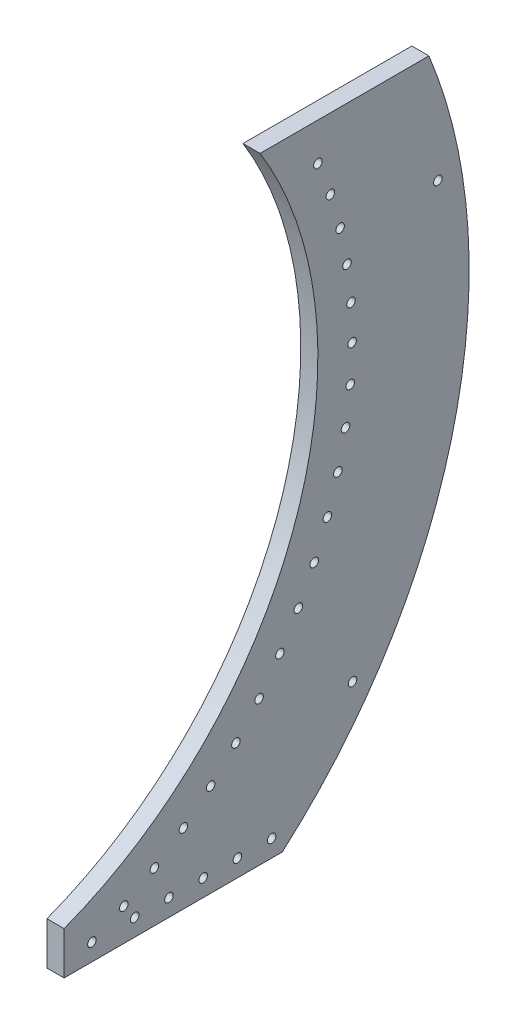
ISO-10303-21;
HEADER;
FILE_DESCRIPTION(('STEP AP214'),'2;1');
FILE_NAME('part.step','',(''),(''),'','','');
FILE_SCHEMA(('AUTOMOTIVE_DESIGN { 1 0 10303 214 1 1 1 1 }'));
ENDSEC;
DATA;
#1=APPLICATION_CONTEXT('core data for automotive mechanical design processes');
#2=APPLICATION_PROTOCOL_DEFINITION('international standard','automotive_design',2000,#1);
#3=PRODUCT_CONTEXT('',#1,'mechanical');
#4=PRODUCT('Part','Part','',(#3));
#5=PRODUCT_RELATED_PRODUCT_CATEGORY('part','',(#4));
#6=PRODUCT_DEFINITION_FORMATION('','',#4);
#7=PRODUCT_DEFINITION_CONTEXT('part definition',#1,'design');
#8=PRODUCT_DEFINITION('design','',#6,#7);
#9=PRODUCT_DEFINITION_SHAPE('','',#8);
#10=(LENGTH_UNIT() NAMED_UNIT(*) SI_UNIT(.MILLI.,.METRE.));
#11=(NAMED_UNIT(*) PLANE_ANGLE_UNIT() SI_UNIT($,.RADIAN.));
#12=(NAMED_UNIT(*) SI_UNIT($,.STERADIAN.) SOLID_ANGLE_UNIT());
#13=UNCERTAINTY_MEASURE_WITH_UNIT(LENGTH_MEASURE(1.E-05),#10,'distance_accuracy_value','');
#14=(GEOMETRIC_REPRESENTATION_CONTEXT(3) GLOBAL_UNCERTAINTY_ASSIGNED_CONTEXT((#13)) GLOBAL_UNIT_ASSIGNED_CONTEXT((#10,
#11,#12)) REPRESENTATION_CONTEXT('',''));
#15=CARTESIAN_POINT('',(0.,0.,0.));
#16=DIRECTION('',(0.,0.,1.));
#17=DIRECTION('',(1.,0.,0.));
#18=AXIS2_PLACEMENT_3D('',#15,#16,#17);
#19=CARTESIAN_POINT('',(12.7,12.7,-52.4380030499122));
#20=DIRECTION('',(-1.,0.,0.));
#21=DIRECTION('',(0.,0.,1.));
#22=AXIS2_PLACEMENT_3D('',#19,#20,#21);
#23=CYLINDRICAL_SURFACE('',#22,3.175);
#24=CARTESIAN_POINT('',(12.7,12.7,-52.4380030499122));
#25=DIRECTION('',(-1.,0.,0.));
#26=DIRECTION('',(0.,0.,1.));
#27=AXIS2_PLACEMENT_3D('',#24,#25,#26);
#28=CIRCLE('',#27,3.175);
#29=CARTESIAN_POINT('',(12.7,12.7,-49.2630030499122));
#30=VERTEX_POINT('',#29);
#31=EDGE_CURVE('E46',#30,#30,#28,.T.);
#32=ORIENTED_EDGE('',*,*,#31,.F.);
#33=EDGE_LOOP('',(#32));
#34=FACE_BOUND('',#33,.T.);
#35=CARTESIAN_POINT('',(0.,12.7,-52.4380030499122));
#36=DIRECTION('',(-1.,0.,0.));
#37=DIRECTION('',(0.,0.,1.));
#38=AXIS2_PLACEMENT_3D('',#35,#36,#37);
#39=CIRCLE('',#38,3.175);
#40=CARTESIAN_POINT('',(0.,12.7,-49.2630030499122));
#41=VERTEX_POINT('',#40);
#42=EDGE_CURVE('E11',#41,#41,#39,.T.);
#43=ORIENTED_EDGE('',*,*,#42,.T.);
#44=EDGE_LOOP('',(#43));
#45=FACE_BOUND('',#44,.T.);
#46=ADVANCED_FACE('F38',(#34,#45),#23,.F.);
#47=CARTESIAN_POINT('',(12.7,12.7,-77.8380030499122));
#48=DIRECTION('',(-1.,0.,0.));
#49=DIRECTION('',(0.,0.,1.));
#50=AXIS2_PLACEMENT_3D('',#47,#48,#49);
#51=CYLINDRICAL_SURFACE('',#50,3.175);
#52=CARTESIAN_POINT('',(12.7,12.7,-77.8380030499122));
#53=DIRECTION('',(-1.,0.,0.));
#54=DIRECTION('',(0.,0.,1.));
#55=AXIS2_PLACEMENT_3D('',#52,#53,#54);
#56=CIRCLE('',#55,3.175);
#57=CARTESIAN_POINT('',(12.7,12.7,-74.6630030499122));
#58=VERTEX_POINT('',#57);
#59=EDGE_CURVE('E121',#58,#58,#56,.T.);
#60=ORIENTED_EDGE('',*,*,#59,.F.);
#61=EDGE_LOOP('',(#60));
#62=FACE_BOUND('',#61,.T.);
#63=CARTESIAN_POINT('',(0.,12.7,-77.8380030499122));
#64=DIRECTION('',(-1.,0.,0.));
#65=DIRECTION('',(0.,0.,1.));
#66=AXIS2_PLACEMENT_3D('',#63,#64,#65);
#67=CIRCLE('',#66,3.175);
#68=CARTESIAN_POINT('',(0.,12.7,-74.6630030499122));
#69=VERTEX_POINT('',#68);
#70=EDGE_CURVE('E125',#69,#69,#67,.T.);
#71=ORIENTED_EDGE('',*,*,#70,.T.);
#72=EDGE_LOOP('',(#71));
#73=FACE_BOUND('',#72,.T.);
#74=ADVANCED_FACE('F136',(#62,#73),#51,.F.);
#75=CARTESIAN_POINT('',(12.7,12.7,-103.238003049912));
#76=DIRECTION('',(-1.,0.,0.));
#77=DIRECTION('',(0.,0.,1.));
#78=AXIS2_PLACEMENT_3D('',#75,#76,#77);
#79=CYLINDRICAL_SURFACE('',#78,3.175);
#80=CARTESIAN_POINT('',(12.7,12.7,-103.238003049912));
#81=DIRECTION('',(-1.,0.,0.));
#82=DIRECTION('',(0.,0.,1.));
#83=AXIS2_PLACEMENT_3D('',#80,#81,#82);
#84=CIRCLE('',#83,3.175);
#85=CARTESIAN_POINT('',(12.7,12.7,-100.063003049912));
#86=VERTEX_POINT('',#85);
#87=EDGE_CURVE('E113',#86,#86,#84,.T.);
#88=ORIENTED_EDGE('',*,*,#87,.F.);
#89=EDGE_LOOP('',(#88));
#90=FACE_BOUND('',#89,.T.);
#91=CARTESIAN_POINT('',(0.,12.7,-103.238003049912));
#92=DIRECTION('',(-1.,0.,0.));
#93=DIRECTION('',(0.,0.,1.));
#94=AXIS2_PLACEMENT_3D('',#91,#92,#93);
#95=CIRCLE('',#94,3.175);
#96=CARTESIAN_POINT('',(0.,12.7,-100.063003049912));
#97=VERTEX_POINT('',#96);
#98=EDGE_CURVE('E117',#97,#97,#95,.T.);
#99=ORIENTED_EDGE('',*,*,#98,.T.);
#100=EDGE_LOOP('',(#99));
#101=FACE_BOUND('',#100,.T.);
#102=ADVANCED_FACE('F163',(#90,#101),#79,.F.);
#103=CARTESIAN_POINT('',(12.7,304.8,103.759854953638));
#104=DIRECTION('',(-1.,0.,0.));
#105=DIRECTION('',(0.,0.,1.));
#106=AXIS2_PLACEMENT_3D('',#103,#104,#105);
#107=CYLINDRICAL_SURFACE('',#106,292.1);
#108=CARTESIAN_POINT('',(12.7,304.8,103.759854953638));
#109=DIRECTION('',(-1.,0.,0.));
#110=DIRECTION('',(0.,0.,1.));
#111=AXIS2_PLACEMENT_3D('',#108,#109,#110);
#112=CIRCLE('',#111,292.1);
#113=CARTESIAN_POINT('',(12.7,457.2,-145.432139299789));
#114=VERTEX_POINT('',#113);
#115=CARTESIAN_POINT('',(12.7,31.75,0.));
#116=VERTEX_POINT('',#115);
#117=EDGE_CURVE('E101',#114,#116,#112,.T.);
#118=ORIENTED_EDGE('',*,*,#117,.F.);
#119=DIRECTION('',(-1.,0.,0.));
#120=VECTOR('',#119,1.);
#121=CARTESIAN_POINT('',(12.7,457.2,-145.432139299789));
#122=LINE('',#121,#120);
#123=CARTESIAN_POINT('',(0.,457.2,-145.432139299789));
#124=VERTEX_POINT('',#123);
#125=EDGE_CURVE('E684',#114,#124,#122,.T.);
#126=ORIENTED_EDGE('',*,*,#125,.T.);
#127=CARTESIAN_POINT('',(0.,304.8,103.759854953638));
#128=DIRECTION('',(-1.,0.,0.));
#129=DIRECTION('',(0.,0.,1.));
#130=AXIS2_PLACEMENT_3D('',#127,#128,#129);
#131=CIRCLE('',#130,292.1);
#132=CARTESIAN_POINT('',(0.,31.75,0.));
#133=VERTEX_POINT('',#132);
#134=EDGE_CURVE('E87',#124,#133,#131,.T.);
#135=ORIENTED_EDGE('',*,*,#134,.T.);
#136=DIRECTION('',(-1.,0.,0.));
#137=VECTOR('',#136,1.);
#138=CARTESIAN_POINT('',(12.7,31.75,0.));
#139=LINE('',#138,#137);
#140=EDGE_CURVE('E81',#116,#133,#139,.T.);
#141=ORIENTED_EDGE('',*,*,#140,.F.);
#142=EDGE_LOOP('',(#118,#126,#135,#141));
#143=FACE_BOUND('',#142,.T.);
#144=ADVANCED_FACE('F160',(#143),#107,.F.);
#145=CARTESIAN_POINT('',(12.7,0.,0.));
#146=DIRECTION('',(0.,0.,-1.));
#147=DIRECTION('',(-1.,0.,0.));
#148=AXIS2_PLACEMENT_3D('',#145,#146,#147);
#149=PLANE('',#148);
#150=DIRECTION('',(0.,-1.,0.));
#151=VECTOR('',#150,1.);
#152=CARTESIAN_POINT('',(0.,0.,0.));
#153=LINE('',#152,#151);
#154=CARTESIAN_POINT('',(0.,0.,0.));
#155=VERTEX_POINT('',#154);
#156=EDGE_CURVE('E75',#133,#155,#153,.T.);
#157=ORIENTED_EDGE('',*,*,#156,.T.);
#158=DIRECTION('',(-1.,0.,0.));
#159=VECTOR('',#158,1.);
#160=CARTESIAN_POINT('',(12.7,0.,0.));
#161=LINE('',#160,#159);
#162=CARTESIAN_POINT('',(12.7,0.,0.));
#163=VERTEX_POINT('',#162);
#164=EDGE_CURVE('E78',#163,#155,#161,.T.);
#165=ORIENTED_EDGE('',*,*,#164,.F.);
#166=DIRECTION('',(0.,-1.,0.));
#167=VECTOR('',#166,1.);
#168=CARTESIAN_POINT('',(12.7,0.,0.));
#169=LINE('',#168,#167);
#170=EDGE_CURVE('E62',#116,#163,#169,.T.);
#171=ORIENTED_EDGE('',*,*,#170,.F.);
#172=ORIENTED_EDGE('',*,*,#140,.T.);
#173=EDGE_LOOP('',(#157,#165,#171,#172));
#174=FACE_BOUND('',#173,.T.);
#175=ADVANCED_FACE('F77',(#174),#149,.F.);
#176=CARTESIAN_POINT('',(12.7,0.,-323.85));
#177=DIRECTION('',(0.,1.,0.));
#178=DIRECTION('',(0.,0.,1.));
#179=AXIS2_PLACEMENT_3D('',#176,#177,#178);
#180=PLANE('',#179);
#181=DIRECTION('',(0.,0.,-1.));
#182=VECTOR('',#181,1.);
#183=CARTESIAN_POINT('',(0.,0.,-323.85));
#184=LINE('',#183,#182);
#185=CARTESIAN_POINT('',(0.,0.,-161.925));
#186=VERTEX_POINT('',#185);
#187=EDGE_CURVE('E86',#155,#186,#184,.T.);
#188=ORIENTED_EDGE('',*,*,#187,.T.);
#189=DIRECTION('',(1.,0.,0.));
#190=VECTOR('',#189,1.);
#191=CARTESIAN_POINT('',(0.,0.,-161.925));
#192=LINE('',#191,#190);
#193=CARTESIAN_POINT('',(12.7,0.,-161.925));
#194=VERTEX_POINT('',#193);
#195=EDGE_CURVE('E511',#186,#194,#192,.T.);
#196=ORIENTED_EDGE('',*,*,#195,.T.);
#197=DIRECTION('',(0.,0.,-1.));
#198=VECTOR('',#197,1.);
#199=CARTESIAN_POINT('',(12.7,0.,-323.85));
#200=LINE('',#199,#198);
#201=EDGE_CURVE('E94',#163,#194,#200,.T.);
#202=ORIENTED_EDGE('',*,*,#201,.F.);
#203=ORIENTED_EDGE('',*,*,#164,.T.);
#204=EDGE_LOOP('',(#188,#196,#202,#203));
#205=FACE_BOUND('',#204,.T.);
#206=ADVANCED_FACE('F91',(#205),#180,.F.);
#207=CARTESIAN_POINT('',(12.7,304.8,103.759854953638));
#208=DIRECTION('',(-1.,0.,0.));
#209=DIRECTION('',(0.,0.,1.));
#210=AXIS2_PLACEMENT_3D('',#207,#208,#209);
#211=PLANE('',#210);
#212=CARTESIAN_POINT('',(12.7,12.7,-128.638003049912));
#213=DIRECTION('',(-1.,0.,0.));
#214=DIRECTION('',(0.,0.,1.));
#215=AXIS2_PLACEMENT_3D('',#212,#213,#214);
#216=CIRCLE('',#215,3.175);
#217=CARTESIAN_POINT('',(12.7,12.7,-125.463003049912));
#218=VERTEX_POINT('',#217);
#219=EDGE_CURVE('E476',#218,#218,#216,.T.);
#220=ORIENTED_EDGE('',*,*,#219,.T.);
#221=EDGE_LOOP('',(#220));
#222=FACE_BOUND('',#221,.T.);
#223=CARTESIAN_POINT('',(12.7,12.7,-154.038003049912));
#224=DIRECTION('',(-1.,0.,0.));
#225=DIRECTION('',(0.,0.,1.));
#226=AXIS2_PLACEMENT_3D('',#223,#224,#225);
#227=CIRCLE('',#226,3.175);
#228=CARTESIAN_POINT('',(12.7,12.7,-150.863003049912));
#229=VERTEX_POINT('',#228);
#230=EDGE_CURVE('E485',#229,#229,#227,.T.);
#231=ORIENTED_EDGE('',*,*,#230,.T.);
#232=EDGE_LOOP('',(#231));
#233=FACE_BOUND('',#232,.T.);
#234=CARTESIAN_POINT('',(12.7,83.3797282703153,-214.065703752946));
#235=DIRECTION('',(1.,0.,0.));
#236=DIRECTION('',(0.,0.,-1.));
#237=AXIS2_PLACEMENT_3D('',#234,#235,#236);
#238=CIRCLE('',#237,3.175);
#239=CARTESIAN_POINT('',(12.7,83.3797282703153,-217.240703752946));
#240=VERTEX_POINT('',#239);
#241=EDGE_CURVE('E498',#240,#240,#238,.T.);
#242=ORIENTED_EDGE('',*,*,#241,.F.);
#243=EDGE_LOOP('',(#242));
#244=FACE_BOUND('',#243,.T.);
#245=CARTESIAN_POINT('',(12.7,373.862081851517,-277.383754923708));
#246=DIRECTION('',(1.,0.,0.));
#247=DIRECTION('',(0.,0.,-1.));
#248=AXIS2_PLACEMENT_3D('',#245,#246,#247);
#249=CIRCLE('',#248,3.17499999999997);
#250=CARTESIAN_POINT('',(12.7,373.862081851517,-280.558754923708));
#251=VERTEX_POINT('',#250);
#252=EDGE_CURVE('E491',#251,#251,#249,.T.);
#253=ORIENTED_EDGE('',*,*,#252,.F.);
#254=EDGE_LOOP('',(#253));
#255=FACE_BOUND('',#254,.T.);
#256=CARTESIAN_POINT('',(12.7,12.7,-20.674223979747));
#257=DIRECTION('',(1.,0.,0.));
#258=DIRECTION('',(0.,0.,-1.));
#259=AXIS2_PLACEMENT_3D('',#256,#257,#258);
#260=CIRCLE('',#259,3.175);
#261=CARTESIAN_POINT('',(12.7,12.7,-23.849223979747));
#262=VERTEX_POINT('',#261);
#263=EDGE_CURVE('E518',#262,#262,#260,.T.);
#264=ORIENTED_EDGE('',*,*,#263,.F.);
#265=EDGE_LOOP('',(#264));
#266=FACE_BOUND('',#265,.T.);
#267=CARTESIAN_POINT('',(12.7,23.9733543855234,-44.37064532541));
#268=DIRECTION('',(1.,0.,0.));
#269=DIRECTION('',(0.,0.,-1.));
#270=AXIS2_PLACEMENT_3D('',#267,#268,#269);
#271=CIRCLE('',#270,3.175);
#272=CARTESIAN_POINT('',(12.7,23.9733543855234,-47.54564532541));
#273=VERTEX_POINT('',#272);
#274=EDGE_CURVE('E528',#273,#273,#271,.T.);
#275=ORIENTED_EDGE('',*,*,#274,.F.);
#276=EDGE_LOOP('',(#275));
#277=FACE_BOUND('',#276,.T.);
#278=CARTESIAN_POINT('',(12.7,37.1650395150662,-67.0551851518159));
#279=DIRECTION('',(1.,0.,0.));
#280=DIRECTION('',(0.,0.,-1.));
#281=AXIS2_PLACEMENT_3D('',#278,#279,#280);
#282=CIRCLE('',#281,3.175);
#283=CARTESIAN_POINT('',(12.7,37.1650395150662,-70.2301851518159));
#284=VERTEX_POINT('',#283);
#285=EDGE_CURVE('E536',#284,#284,#282,.T.);
#286=ORIENTED_EDGE('',*,*,#285,.F.);
#287=EDGE_LOOP('',(#286));
#288=FACE_BOUND('',#287,.T.);
#289=CARTESIAN_POINT('',(12.7,52.184942803001,-88.5728850501294));
#290=DIRECTION('',(1.,0.,0.));
#291=DIRECTION('',(0.,0.,-1.));
#292=AXIS2_PLACEMENT_3D('',#289,#290,#291);
#293=CIRCLE('',#292,3.175);
#294=CARTESIAN_POINT('',(12.7,52.184942803001,-91.7478850501294));
#295=VERTEX_POINT('',#294);
#296=EDGE_CURVE('E544',#295,#295,#293,.T.);
#297=ORIENTED_EDGE('',*,*,#296,.F.);
#298=EDGE_LOOP('',(#297));
#299=FACE_BOUND('',#298,.T.);
#300=CARTESIAN_POINT('',(12.7,68.9304630798894,-108.776757311385));
#301=DIRECTION('',(1.,0.,0.));
#302=DIRECTION('',(0.,0.,-1.));
#303=AXIS2_PLACEMENT_3D('',#300,#301,#302);
#304=CIRCLE('',#303,3.175);
#305=CARTESIAN_POINT('',(12.7,68.9304630798894,-111.951757311385));
#306=VERTEX_POINT('',#305);
#307=EDGE_CURVE('E552',#306,#306,#304,.T.);
#308=ORIENTED_EDGE('',*,*,#307,.F.);
#309=EDGE_LOOP('',(#308));
#310=FACE_BOUND('',#309,.T.);
#311=CARTESIAN_POINT('',(12.7,87.2872114625064,-127.52878900158));
#312=DIRECTION('',(1.,0.,0.));
#313=DIRECTION('',(0.,0.,-1.));
#314=AXIS2_PLACEMENT_3D('',#311,#312,#313);
#315=CIRCLE('',#314,3.175);
#316=CARTESIAN_POINT('',(12.7,87.2872114625064,-130.70378900158));
#317=VERTEX_POINT('',#316);
#318=EDGE_CURVE('E560',#317,#317,#315,.T.);
#319=ORIENTED_EDGE('',*,*,#318,.F.);
#320=EDGE_LOOP('',(#319));
#321=FACE_BOUND('',#320,.T.);
#322=CARTESIAN_POINT('',(12.7,107.1297927459,-144.700884729961));
#323=DIRECTION('',(1.,0.,0.));
#324=DIRECTION('',(0.,0.,-1.));
#325=AXIS2_PLACEMENT_3D('',#322,#323,#324);
#326=CIRCLE('',#325,3.175);
#327=CARTESIAN_POINT('',(12.7,107.1297927459,-147.875884729961));
#328=VERTEX_POINT('',#327);
#329=EDGE_CURVE('E568',#328,#328,#326,.T.);
#330=ORIENTED_EDGE('',*,*,#329,.F.);
#331=EDGE_LOOP('',(#330));
#332=FACE_BOUND('',#331,.T.);
#333=CARTESIAN_POINT('',(12.7,128.322661979793,-160.175741670428));
#334=DIRECTION('',(1.,0.,0.));
#335=DIRECTION('',(0.,0.,-1.));
#336=AXIS2_PLACEMENT_3D('',#333,#334,#335);
#337=CIRCLE('',#336,3.17500000000001);
#338=CARTESIAN_POINT('',(12.7,128.322661979793,-163.350741670428));
#339=VERTEX_POINT('',#338);
#340=EDGE_CURVE('E576',#339,#339,#337,.T.);
#341=ORIENTED_EDGE('',*,*,#340,.F.);
#342=EDGE_LOOP('',(#341));
#343=FACE_BOUND('',#342,.T.);
#344=CARTESIAN_POINT('',(12.7,150.721050378031,-173.847650858778));
#345=DIRECTION('',(1.,0.,0.));
#346=DIRECTION('',(0.,0.,-1.));
#347=AXIS2_PLACEMENT_3D('',#344,#345,#346);
#348=CIRCLE('',#347,3.17500000000001);
#349=CARTESIAN_POINT('',(12.7,150.721050378031,-177.022650858778));
#350=VERTEX_POINT('',#349);
#351=EDGE_CURVE('E584',#350,#350,#348,.T.);
#352=ORIENTED_EDGE('',*,*,#351,.F.);
#353=EDGE_LOOP('',(#352));
#354=FACE_BOUND('',#353,.T.);
#355=CARTESIAN_POINT('',(12.7,174.171954236186,-185.623219292122));
#356=DIRECTION('',(1.,0.,0.));
#357=DIRECTION('',(0.,0.,-1.));
#358=AXIS2_PLACEMENT_3D('',#355,#356,#357);
#359=CIRCLE('',#358,3.17500000000001);
#360=CARTESIAN_POINT('',(12.7,174.171954236186,-188.798219292122));
#361=VERTEX_POINT('',#360);
#362=EDGE_CURVE('E592',#361,#361,#359,.T.);
#363=ORIENTED_EDGE('',*,*,#362,.F.);
#364=EDGE_LOOP('',(#363));
#365=FACE_BOUND('',#364,.T.);
#366=CARTESIAN_POINT('',(12.7,198.515180102004,-195.42200789779));
#367=DIRECTION('',(1.,0.,0.));
#368=DIRECTION('',(0.,0.,-1.));
#369=AXIS2_PLACEMENT_3D('',#366,#367,#368);
#370=CIRCLE('',#369,3.17500000000001);
#371=CARTESIAN_POINT('',(12.7,198.515180102004,-198.59700789779));
#372=VERTEX_POINT('',#371);
#373=EDGE_CURVE('E600',#372,#372,#370,.T.);
#374=ORIENTED_EDGE('',*,*,#373,.F.);
#375=EDGE_LOOP('',(#374));
#376=FACE_BOUND('',#375,.T.);
#377=CARTESIAN_POINT('',(12.7,223.584439059115,-203.177081013765));
#378=DIRECTION('',(1.,0.,0.));
#379=DIRECTION('',(0.,0.,-1.));
#380=AXIS2_PLACEMENT_3D('',#377,#378,#379);
#381=CIRCLE('',#380,3.17500000000001);
#382=CARTESIAN_POINT('',(12.7,223.584439059115,-206.352081013765));
#383=VERTEX_POINT('',#382);
#384=EDGE_CURVE('E608',#383,#383,#381,.T.);
#385=ORIENTED_EDGE('',*,*,#384,.F.);
#386=EDGE_LOOP('',(#385));
#387=FACE_BOUND('',#386,.T.);
#388=CARTESIAN_POINT('',(12.7,249.208482648947,-208.835463627123));
#389=DIRECTION('',(1.,0.,0.));
#390=DIRECTION('',(0.,0.,-1.));
#391=AXIS2_PLACEMENT_3D('',#388,#389,#390);
#392=CIRCLE('',#391,3.17499999999998);
#393=CARTESIAN_POINT('',(12.7,249.208482648947,-212.010463627123));
#394=VERTEX_POINT('',#393);
#395=EDGE_CURVE('E616',#394,#394,#392,.T.);
#396=ORIENTED_EDGE('',*,*,#395,.F.);
#397=EDGE_LOOP('',(#396));
#398=FACE_BOUND('',#397,.T.);
#399=CARTESIAN_POINT('',(12.7,275.212272671344,-212.358503247092));
#400=DIRECTION('',(1.,0.,0.));
#401=DIRECTION('',(0.,0.,-1.));
#402=AXIS2_PLACEMENT_3D('',#399,#400,#401);
#403=CIRCLE('',#402,3.17499999999998);
#404=CARTESIAN_POINT('',(12.7,275.212272671344,-215.533503247092));
#405=VERTEX_POINT('',#404);
#406=EDGE_CURVE('E624',#405,#405,#403,.T.);
#407=ORIENTED_EDGE('',*,*,#406,.F.);
#408=EDGE_LOOP('',(#407));
#409=FACE_BOUND('',#408,.T.);
#410=CARTESIAN_POINT('',(12.7,301.418176872957,-213.722133940752));
#411=DIRECTION('',(1.,0.,0.));
#412=DIRECTION('',(0.,0.,-1.));
#413=AXIS2_PLACEMENT_3D('',#410,#411,#412);
#414=CIRCLE('',#413,3.17499999999998);
#415=CARTESIAN_POINT('',(12.7,301.418176872957,-216.897133940752));
#416=VERTEX_POINT('',#415);
#417=EDGE_CURVE('E632',#416,#416,#414,.T.);
#418=ORIENTED_EDGE('',*,*,#417,.F.);
#419=EDGE_LOOP('',(#418));
#420=FACE_BOUND('',#419,.T.);
#421=CARTESIAN_POINT('',(12.7,327.647182355651,-212.917040727761));
#422=DIRECTION('',(1.,0.,0.));
#423=DIRECTION('',(0.,0.,-1.));
#424=AXIS2_PLACEMENT_3D('',#421,#422,#423);
#425=CIRCLE('',#424,3.17499999999998);
#426=CARTESIAN_POINT('',(12.7,327.647182355651,-216.092040727761));
#427=VERTEX_POINT('',#426);
#428=EDGE_CURVE('E640',#427,#427,#425,.T.);
#429=ORIENTED_EDGE('',*,*,#428,.F.);
#430=EDGE_LOOP('',(#429));
#431=FACE_BOUND('',#430,.T.);
#432=CARTESIAN_POINT('',(12.7,353.720118416118,-209.948723211119));
#433=DIRECTION('',(1.,0.,0.));
#434=DIRECTION('',(0.,0.,-1.));
#435=AXIS2_PLACEMENT_3D('',#432,#433,#434);
#436=CIRCLE('',#435,3.17499999999998);
#437=CARTESIAN_POINT('',(12.7,353.720118416118,-213.123723211119));
#438=VERTEX_POINT('',#437);
#439=EDGE_CURVE('E648',#438,#438,#436,.T.);
#440=ORIENTED_EDGE('',*,*,#439,.F.);
#441=EDGE_LOOP('',(#440));
#442=FACE_BOUND('',#441,.T.);
#443=CARTESIAN_POINT('',(12.7,379.458880463455,-204.837458009297));
#444=DIRECTION('',(1.,0.,0.));
#445=DIRECTION('',(0.,0.,-1.));
#446=AXIS2_PLACEMENT_3D('',#443,#444,#445);
#447=CIRCLE('',#446,3.17499999999998);
#448=CARTESIAN_POINT('',(12.7,379.458880463455,-208.012458009297));
#449=VERTEX_POINT('',#448);
#450=EDGE_CURVE('E656',#449,#449,#447,.T.);
#451=ORIENTED_EDGE('',*,*,#450,.F.);
#452=EDGE_LOOP('',(#451));
#453=FACE_BOUND('',#452,.T.);
#454=CARTESIAN_POINT('',(12.7,404.687646654118,-197.61816024638));
#455=DIRECTION('',(1.,0.,0.));
#456=DIRECTION('',(0.,0.,-1.));
#457=AXIS2_PLACEMENT_3D('',#454,#455,#456);
#458=CIRCLE('',#457,3.17499999999998);
#459=CARTESIAN_POINT('',(12.7,404.687646654118,-200.79316024638));
#460=VERTEX_POINT('',#459);
#461=EDGE_CURVE('E664',#460,#460,#458,.T.);
#462=ORIENTED_EDGE('',*,*,#461,.F.);
#463=EDGE_LOOP('',(#462));
#464=FACE_BOUND('',#463,.T.);
#465=CARTESIAN_POINT('',(12.7,429.234078933392,-188.34014504636));
#466=DIRECTION('',(1.,0.,0.));
#467=DIRECTION('',(0.,0.,-1.));
#468=AXIS2_PLACEMENT_3D('',#465,#466,#467);
#469=CIRCLE('',#468,3.17499999999998);
#470=CARTESIAN_POINT('',(12.7,429.234078933392,-191.51514504636));
#471=VERTEX_POINT('',#470);
#472=EDGE_CURVE('E672',#471,#471,#469,.T.);
#473=ORIENTED_EDGE('',*,*,#472,.F.);
#474=EDGE_LOOP('',(#473));
#475=FACE_BOUND('',#474,.T.);
#476=ORIENTED_EDGE('',*,*,#201,.T.);
#477=CARTESIAN_POINT('',(12.7,304.8,103.759854953638));
#478=DIRECTION('',(-1.,0.,0.));
#479=DIRECTION('',(0.,0.,-1.));
#480=AXIS2_PLACEMENT_3D('',#477,#478,#479);
#481=CIRCLE('',#480,404.340799514142);
#482=CARTESIAN_POINT('',(12.7,457.2,-270.7608015551));
#483=VERTEX_POINT('',#482);
#484=EDGE_CURVE('E497',#483,#194,#481,.T.);
#485=ORIENTED_EDGE('',*,*,#484,.F.);
#486=DIRECTION('',(0.,0.,-1.));
#487=VECTOR('',#486,1.);
#488=CARTESIAN_POINT('',(12.7,457.2,0.));
#489=LINE('',#488,#487);
#490=EDGE_CURVE('E680',#114,#483,#489,.T.);
#491=ORIENTED_EDGE('',*,*,#490,.F.);
#492=ORIENTED_EDGE('',*,*,#117,.T.);
#493=ORIENTED_EDGE('',*,*,#170,.T.);
#494=EDGE_LOOP('',(#476,#485,#491,#492,#493));
#495=FACE_BOUND('',#494,.T.);
#496=ORIENTED_EDGE('',*,*,#87,.T.);
#497=EDGE_LOOP('',(#496));
#498=FACE_BOUND('',#497,.T.);
#499=ORIENTED_EDGE('',*,*,#59,.T.);
#500=EDGE_LOOP('',(#499));
#501=FACE_BOUND('',#500,.T.);
#502=ORIENTED_EDGE('',*,*,#31,.T.);
#503=EDGE_LOOP('',(#502));
#504=FACE_BOUND('',#503,.T.);
#505=ADVANCED_FACE('F132',(#222,#233,#244,#255,#266,#277,#288,#299,#310,#321,#332,#343,#354,
#365,#376,#387,#398,#409,#420,#431,#442,#453,#464,#475,#495,#498,#501,#504),#211,.F.);
#506=CARTESIAN_POINT('',(0.,304.8,103.759854953638));
#507=DIRECTION('',(-1.,0.,0.));
#508=DIRECTION('',(0.,0.,1.));
#509=AXIS2_PLACEMENT_3D('',#506,#507,#508);
#510=PLANE('',#509);
#511=CARTESIAN_POINT('',(0.,12.7,-128.638003049912));
#512=DIRECTION('',(-1.,0.,0.));
#513=DIRECTION('',(0.,0.,1.));
#514=AXIS2_PLACEMENT_3D('',#511,#512,#513);
#515=CIRCLE('',#514,3.175);
#516=CARTESIAN_POINT('',(0.,12.7,-125.463003049912));
#517=VERTEX_POINT('',#516);
#518=EDGE_CURVE('E478',#517,#517,#515,.T.);
#519=ORIENTED_EDGE('',*,*,#518,.F.);
#520=EDGE_LOOP('',(#519));
#521=FACE_BOUND('',#520,.T.);
#522=CARTESIAN_POINT('',(0.,12.7,-154.038003049912));
#523=DIRECTION('',(-1.,0.,0.));
#524=DIRECTION('',(0.,0.,1.));
#525=AXIS2_PLACEMENT_3D('',#522,#523,#524);
#526=CIRCLE('',#525,3.175);
#527=CARTESIAN_POINT('',(0.,12.7,-150.863003049912));
#528=VERTEX_POINT('',#527);
#529=EDGE_CURVE('E480',#528,#528,#526,.T.);
#530=ORIENTED_EDGE('',*,*,#529,.F.);
#531=EDGE_LOOP('',(#530));
#532=FACE_BOUND('',#531,.T.);
#533=CARTESIAN_POINT('',(0.,83.3797282703153,-214.065703752946));
#534=DIRECTION('',(1.,0.,0.));
#535=DIRECTION('',(0.,0.,-1.));
#536=AXIS2_PLACEMENT_3D('',#533,#534,#535);
#537=CIRCLE('',#536,3.175);
#538=CARTESIAN_POINT('',(0.,83.3797282703153,-217.240703752946));
#539=VERTEX_POINT('',#538);
#540=EDGE_CURVE('E493',#539,#539,#537,.T.);
#541=ORIENTED_EDGE('',*,*,#540,.T.);
#542=EDGE_LOOP('',(#541));
#543=FACE_BOUND('',#542,.T.);
#544=CARTESIAN_POINT('',(0.,373.862081851517,-277.383754923708));
#545=DIRECTION('',(1.,0.,0.));
#546=DIRECTION('',(0.,0.,-1.));
#547=AXIS2_PLACEMENT_3D('',#544,#545,#546);
#548=CIRCLE('',#547,3.17499999999997);
#549=CARTESIAN_POINT('',(0.,373.862081851517,-280.558754923708));
#550=VERTEX_POINT('',#549);
#551=EDGE_CURVE('E502',#550,#550,#548,.T.);
#552=ORIENTED_EDGE('',*,*,#551,.T.);
#553=EDGE_LOOP('',(#552));
#554=FACE_BOUND('',#553,.T.);
#555=CARTESIAN_POINT('',(0.,304.8,103.759854953638));
#556=DIRECTION('',(-1.,0.,0.));
#557=DIRECTION('',(0.,0.,-1.));
#558=AXIS2_PLACEMENT_3D('',#555,#556,#557);
#559=CIRCLE('',#558,404.340799514142);
#560=CARTESIAN_POINT('',(0.,457.2,-270.7608015551));
#561=VERTEX_POINT('',#560);
#562=EDGE_CURVE('E53',#561,#186,#559,.T.);
#563=ORIENTED_EDGE('',*,*,#562,.T.);
#564=ORIENTED_EDGE('',*,*,#187,.F.);
#565=ORIENTED_EDGE('',*,*,#156,.F.);
#566=ORIENTED_EDGE('',*,*,#134,.F.);
#567=DIRECTION('',(0.,0.,1.));
#568=VECTOR('',#567,1.);
#569=CARTESIAN_POINT('',(0.,457.2,103.759854953638));
#570=LINE('',#569,#568);
#571=EDGE_CURVE('E109',#561,#124,#570,.T.);
#572=ORIENTED_EDGE('',*,*,#571,.F.);
#573=EDGE_LOOP('',(#563,#564,#565,#566,#572));
#574=FACE_BOUND('',#573,.T.);
#575=CARTESIAN_POINT('',(0.,12.7,-20.674223979747));
#576=DIRECTION('',(1.,0.,0.));
#577=DIRECTION('',(0.,0.,-1.));
#578=AXIS2_PLACEMENT_3D('',#575,#576,#577);
#579=CIRCLE('',#578,3.175);
#580=CARTESIAN_POINT('',(0.,12.7,-23.849223979747));
#581=VERTEX_POINT('',#580);
#582=EDGE_CURVE('E524',#581,#581,#579,.T.);
#583=ORIENTED_EDGE('',*,*,#582,.T.);
#584=EDGE_LOOP('',(#583));
#585=FACE_BOUND('',#584,.T.);
#586=CARTESIAN_POINT('',(0.,23.9733543855234,-44.37064532541));
#587=DIRECTION('',(1.,0.,0.));
#588=DIRECTION('',(0.,0.,-1.));
#589=AXIS2_PLACEMENT_3D('',#586,#587,#588);
#590=CIRCLE('',#589,3.175);
#591=CARTESIAN_POINT('',(0.,23.9733543855234,-47.54564532541));
#592=VERTEX_POINT('',#591);
#593=EDGE_CURVE('E532',#592,#592,#590,.T.);
#594=ORIENTED_EDGE('',*,*,#593,.T.);
#595=EDGE_LOOP('',(#594));
#596=FACE_BOUND('',#595,.T.);
#597=CARTESIAN_POINT('',(0.,37.1650395150662,-67.0551851518159));
#598=DIRECTION('',(1.,0.,0.));
#599=DIRECTION('',(0.,0.,-1.));
#600=AXIS2_PLACEMENT_3D('',#597,#598,#599);
#601=CIRCLE('',#600,3.175);
#602=CARTESIAN_POINT('',(0.,37.1650395150662,-70.2301851518159));
#603=VERTEX_POINT('',#602);
#604=EDGE_CURVE('E540',#603,#603,#601,.T.);
#605=ORIENTED_EDGE('',*,*,#604,.T.);
#606=EDGE_LOOP('',(#605));
#607=FACE_BOUND('',#606,.T.);
#608=CARTESIAN_POINT('',(0.,52.184942803001,-88.5728850501294));
#609=DIRECTION('',(1.,0.,0.));
#610=DIRECTION('',(0.,0.,-1.));
#611=AXIS2_PLACEMENT_3D('',#608,#609,#610);
#612=CIRCLE('',#611,3.175);
#613=CARTESIAN_POINT('',(0.,52.184942803001,-91.7478850501294));
#614=VERTEX_POINT('',#613);
#615=EDGE_CURVE('E548',#614,#614,#612,.T.);
#616=ORIENTED_EDGE('',*,*,#615,.T.);
#617=EDGE_LOOP('',(#616));
#618=FACE_BOUND('',#617,.T.);
#619=CARTESIAN_POINT('',(0.,68.9304630798894,-108.776757311385));
#620=DIRECTION('',(1.,0.,0.));
#621=DIRECTION('',(0.,0.,-1.));
#622=AXIS2_PLACEMENT_3D('',#619,#620,#621);
#623=CIRCLE('',#622,3.175);
#624=CARTESIAN_POINT('',(0.,68.9304630798894,-111.951757311385));
#625=VERTEX_POINT('',#624);
#626=EDGE_CURVE('E556',#625,#625,#623,.T.);
#627=ORIENTED_EDGE('',*,*,#626,.T.);
#628=EDGE_LOOP('',(#627));
#629=FACE_BOUND('',#628,.T.);
#630=CARTESIAN_POINT('',(0.,87.2872114625064,-127.52878900158));
#631=DIRECTION('',(1.,0.,0.));
#632=DIRECTION('',(0.,0.,-1.));
#633=AXIS2_PLACEMENT_3D('',#630,#631,#632);
#634=CIRCLE('',#633,3.175);
#635=CARTESIAN_POINT('',(0.,87.2872114625064,-130.70378900158));
#636=VERTEX_POINT('',#635);
#637=EDGE_CURVE('E564',#636,#636,#634,.T.);
#638=ORIENTED_EDGE('',*,*,#637,.T.);
#639=EDGE_LOOP('',(#638));
#640=FACE_BOUND('',#639,.T.);
#641=CARTESIAN_POINT('',(0.,107.1297927459,-144.700884729961));
#642=DIRECTION('',(1.,0.,0.));
#643=DIRECTION('',(0.,0.,-1.));
#644=AXIS2_PLACEMENT_3D('',#641,#642,#643);
#645=CIRCLE('',#644,3.175);
#646=CARTESIAN_POINT('',(0.,107.1297927459,-147.875884729961));
#647=VERTEX_POINT('',#646);
#648=EDGE_CURVE('E572',#647,#647,#645,.T.);
#649=ORIENTED_EDGE('',*,*,#648,.T.);
#650=EDGE_LOOP('',(#649));
#651=FACE_BOUND('',#650,.T.);
#652=CARTESIAN_POINT('',(0.,128.322661979793,-160.175741670428));
#653=DIRECTION('',(1.,0.,0.));
#654=DIRECTION('',(0.,0.,-1.));
#655=AXIS2_PLACEMENT_3D('',#652,#653,#654);
#656=CIRCLE('',#655,3.17499999999998);
#657=CARTESIAN_POINT('',(0.,128.322661979793,-163.350741670428));
#658=VERTEX_POINT('',#657);
#659=EDGE_CURVE('E580',#658,#658,#656,.T.);
#660=ORIENTED_EDGE('',*,*,#659,.T.);
#661=EDGE_LOOP('',(#660));
#662=FACE_BOUND('',#661,.T.);
#663=CARTESIAN_POINT('',(0.,150.721050378031,-173.847650858778));
#664=DIRECTION('',(1.,0.,0.));
#665=DIRECTION('',(0.,0.,-1.));
#666=AXIS2_PLACEMENT_3D('',#663,#664,#665);
#667=CIRCLE('',#666,3.17499999999998);
#668=CARTESIAN_POINT('',(0.,150.721050378031,-177.022650858778));
#669=VERTEX_POINT('',#668);
#670=EDGE_CURVE('E588',#669,#669,#667,.T.);
#671=ORIENTED_EDGE('',*,*,#670,.T.);
#672=EDGE_LOOP('',(#671));
#673=FACE_BOUND('',#672,.T.);
#674=CARTESIAN_POINT('',(0.,174.171954236186,-185.623219292122));
#675=DIRECTION('',(1.,0.,0.));
#676=DIRECTION('',(0.,0.,-1.));
#677=AXIS2_PLACEMENT_3D('',#674,#675,#676);
#678=CIRCLE('',#677,3.17499999999998);
#679=CARTESIAN_POINT('',(0.,174.171954236186,-188.798219292122));
#680=VERTEX_POINT('',#679);
#681=EDGE_CURVE('E596',#680,#680,#678,.T.);
#682=ORIENTED_EDGE('',*,*,#681,.T.);
#683=EDGE_LOOP('',(#682));
#684=FACE_BOUND('',#683,.T.);
#685=CARTESIAN_POINT('',(0.,198.515180102004,-195.42200789779));
#686=DIRECTION('',(1.,0.,0.));
#687=DIRECTION('',(0.,0.,-1.));
#688=AXIS2_PLACEMENT_3D('',#685,#686,#687);
#689=CIRCLE('',#688,3.17499999999998);
#690=CARTESIAN_POINT('',(0.,198.515180102004,-198.59700789779));
#691=VERTEX_POINT('',#690);
#692=EDGE_CURVE('E604',#691,#691,#689,.T.);
#693=ORIENTED_EDGE('',*,*,#692,.T.);
#694=EDGE_LOOP('',(#693));
#695=FACE_BOUND('',#694,.T.);
#696=CARTESIAN_POINT('',(0.,223.584439059115,-203.177081013765));
#697=DIRECTION('',(1.,0.,0.));
#698=DIRECTION('',(0.,0.,-1.));
#699=AXIS2_PLACEMENT_3D('',#696,#697,#698);
#700=CIRCLE('',#699,3.17499999999998);
#701=CARTESIAN_POINT('',(0.,223.584439059115,-206.352081013765));
#702=VERTEX_POINT('',#701);
#703=EDGE_CURVE('E612',#702,#702,#700,.T.);
#704=ORIENTED_EDGE('',*,*,#703,.T.);
#705=EDGE_LOOP('',(#704));
#706=FACE_BOUND('',#705,.T.);
#707=CARTESIAN_POINT('',(0.,249.208482648947,-208.835463627123));
#708=DIRECTION('',(1.,0.,0.));
#709=DIRECTION('',(0.,0.,-1.));
#710=AXIS2_PLACEMENT_3D('',#707,#708,#709);
#711=CIRCLE('',#710,3.17499999999998);
#712=CARTESIAN_POINT('',(0.,249.208482648947,-212.010463627123));
#713=VERTEX_POINT('',#712);
#714=EDGE_CURVE('E620',#713,#713,#711,.T.);
#715=ORIENTED_EDGE('',*,*,#714,.T.);
#716=EDGE_LOOP('',(#715));
#717=FACE_BOUND('',#716,.T.);
#718=CARTESIAN_POINT('',(0.,275.212272671344,-212.358503247092));
#719=DIRECTION('',(1.,0.,0.));
#720=DIRECTION('',(0.,0.,-1.));
#721=AXIS2_PLACEMENT_3D('',#718,#719,#720);
#722=CIRCLE('',#721,3.17499999999998);
#723=CARTESIAN_POINT('',(0.,275.212272671344,-215.533503247092));
#724=VERTEX_POINT('',#723);
#725=EDGE_CURVE('E628',#724,#724,#722,.T.);
#726=ORIENTED_EDGE('',*,*,#725,.T.);
#727=EDGE_LOOP('',(#726));
#728=FACE_BOUND('',#727,.T.);
#729=CARTESIAN_POINT('',(0.,301.418176872957,-213.722133940752));
#730=DIRECTION('',(1.,0.,0.));
#731=DIRECTION('',(0.,0.,-1.));
#732=AXIS2_PLACEMENT_3D('',#729,#730,#731);
#733=CIRCLE('',#732,3.17499999999998);
#734=CARTESIAN_POINT('',(0.,301.418176872957,-216.897133940752));
#735=VERTEX_POINT('',#734);
#736=EDGE_CURVE('E636',#735,#735,#733,.T.);
#737=ORIENTED_EDGE('',*,*,#736,.T.);
#738=EDGE_LOOP('',(#737));
#739=FACE_BOUND('',#738,.T.);
#740=CARTESIAN_POINT('',(0.,327.647182355651,-212.917040727761));
#741=DIRECTION('',(1.,0.,0.));
#742=DIRECTION('',(0.,0.,-1.));
#743=AXIS2_PLACEMENT_3D('',#740,#741,#742);
#744=CIRCLE('',#743,3.17499999999998);
#745=CARTESIAN_POINT('',(0.,327.647182355651,-216.092040727761));
#746=VERTEX_POINT('',#745);
#747=EDGE_CURVE('E644',#746,#746,#744,.T.);
#748=ORIENTED_EDGE('',*,*,#747,.T.);
#749=EDGE_LOOP('',(#748));
#750=FACE_BOUND('',#749,.T.);
#751=CARTESIAN_POINT('',(0.,353.720118416118,-209.948723211119));
#752=DIRECTION('',(1.,0.,0.));
#753=DIRECTION('',(0.,0.,-1.));
#754=AXIS2_PLACEMENT_3D('',#751,#752,#753);
#755=CIRCLE('',#754,3.17499999999998);
#756=CARTESIAN_POINT('',(0.,353.720118416118,-213.123723211119));
#757=VERTEX_POINT('',#756);
#758=EDGE_CURVE('E652',#757,#757,#755,.T.);
#759=ORIENTED_EDGE('',*,*,#758,.T.);
#760=EDGE_LOOP('',(#759));
#761=FACE_BOUND('',#760,.T.);
#762=CARTESIAN_POINT('',(0.,379.458880463455,-204.837458009297));
#763=DIRECTION('',(1.,0.,0.));
#764=DIRECTION('',(0.,0.,-1.));
#765=AXIS2_PLACEMENT_3D('',#762,#763,#764);
#766=CIRCLE('',#765,3.17499999999998);
#767=CARTESIAN_POINT('',(0.,379.458880463455,-208.012458009297));
#768=VERTEX_POINT('',#767);
#769=EDGE_CURVE('E660',#768,#768,#766,.T.);
#770=ORIENTED_EDGE('',*,*,#769,.T.);
#771=EDGE_LOOP('',(#770));
#772=FACE_BOUND('',#771,.T.);
#773=CARTESIAN_POINT('',(0.,404.687646654118,-197.61816024638));
#774=DIRECTION('',(1.,0.,0.));
#775=DIRECTION('',(0.,0.,-1.));
#776=AXIS2_PLACEMENT_3D('',#773,#774,#775);
#777=CIRCLE('',#776,3.17499999999998);
#778=CARTESIAN_POINT('',(0.,404.687646654118,-200.79316024638));
#779=VERTEX_POINT('',#778);
#780=EDGE_CURVE('E668',#779,#779,#777,.T.);
#781=ORIENTED_EDGE('',*,*,#780,.T.);
#782=EDGE_LOOP('',(#781));
#783=FACE_BOUND('',#782,.T.);
#784=CARTESIAN_POINT('',(0.,429.234078933392,-188.34014504636));
#785=DIRECTION('',(1.,0.,0.));
#786=DIRECTION('',(0.,0.,-1.));
#787=AXIS2_PLACEMENT_3D('',#784,#785,#786);
#788=CIRCLE('',#787,3.17499999999998);
#789=CARTESIAN_POINT('',(0.,429.234078933392,-191.51514504636));
#790=VERTEX_POINT('',#789);
#791=EDGE_CURVE('E676',#790,#790,#788,.T.);
#792=ORIENTED_EDGE('',*,*,#791,.T.);
#793=EDGE_LOOP('',(#792));
#794=FACE_BOUND('',#793,.T.);
#795=ORIENTED_EDGE('',*,*,#98,.F.);
#796=EDGE_LOOP('',(#795));
#797=FACE_BOUND('',#796,.T.);
#798=ORIENTED_EDGE('',*,*,#70,.F.);
#799=EDGE_LOOP('',(#798));
#800=FACE_BOUND('',#799,.T.);
#801=ORIENTED_EDGE('',*,*,#42,.F.);
#802=EDGE_LOOP('',(#801));
#803=FACE_BOUND('',#802,.T.);
#804=ADVANCED_FACE('F97',(#521,#532,#543,#554,#574,#585,#596,#607,#618,#629,#640,#651,#662,#673,
#684,#695,#706,#717,#728,#739,#750,#761,#772,#783,#794,#797,#800,#803),#510,.T.);
#805=CARTESIAN_POINT('',(0.,457.2,0.));
#806=DIRECTION('',(0.,-1.,0.));
#807=DIRECTION('',(0.,0.,-1.));
#808=AXIS2_PLACEMENT_3D('',#805,#806,#807);
#809=PLANE('',#808);
#810=ORIENTED_EDGE('',*,*,#490,.T.);
#811=DIRECTION('',(1.,0.,0.));
#812=VECTOR('',#811,1.);
#813=CARTESIAN_POINT('',(0.,457.2,-270.7608015551));
#814=LINE('',#813,#812);
#815=EDGE_CURVE('E515',#561,#483,#814,.T.);
#816=ORIENTED_EDGE('',*,*,#815,.F.);
#817=ORIENTED_EDGE('',*,*,#571,.T.);
#818=ORIENTED_EDGE('',*,*,#125,.F.);
#819=EDGE_LOOP('',(#810,#816,#817,#818));
#820=FACE_BOUND('',#819,.T.);
#821=ADVANCED_FACE('F140',(#820),#809,.F.);
#822=CARTESIAN_POINT('',(12.7,429.234078933392,-188.34014504636));
#823=DIRECTION('',(1.,0.,0.));
#824=DIRECTION('',(0.,0.,-1.));
#825=AXIS2_PLACEMENT_3D('',#822,#823,#824);
#826=CYLINDRICAL_SURFACE('',#825,3.17499999999998);
#827=ORIENTED_EDGE('',*,*,#791,.F.);
#828=EDGE_LOOP('',(#827));
#829=FACE_BOUND('',#828,.T.);
#830=ORIENTED_EDGE('',*,*,#472,.T.);
#831=EDGE_LOOP('',(#830));
#832=FACE_BOUND('',#831,.T.);
#833=ADVANCED_FACE('F148',(#829,#832),#826,.F.);
#834=CARTESIAN_POINT('',(12.7,404.687646654118,-197.61816024638));
#835=DIRECTION('',(1.,0.,0.));
#836=DIRECTION('',(0.,0.,-1.));
#837=AXIS2_PLACEMENT_3D('',#834,#835,#836);
#838=CYLINDRICAL_SURFACE('',#837,3.17499999999998);
#839=ORIENTED_EDGE('',*,*,#780,.F.);
#840=EDGE_LOOP('',(#839));
#841=FACE_BOUND('',#840,.T.);
#842=ORIENTED_EDGE('',*,*,#461,.T.);
#843=EDGE_LOOP('',(#842));
#844=FACE_BOUND('',#843,.T.);
#845=ADVANCED_FACE('F193',(#841,#844),#838,.F.);
#846=CARTESIAN_POINT('',(12.7,379.458880463455,-204.837458009297));
#847=DIRECTION('',(1.,0.,0.));
#848=DIRECTION('',(0.,0.,-1.));
#849=AXIS2_PLACEMENT_3D('',#846,#847,#848);
#850=CYLINDRICAL_SURFACE('',#849,3.17499999999998);
#851=ORIENTED_EDGE('',*,*,#769,.F.);
#852=EDGE_LOOP('',(#851));
#853=FACE_BOUND('',#852,.T.);
#854=ORIENTED_EDGE('',*,*,#450,.T.);
#855=EDGE_LOOP('',(#854));
#856=FACE_BOUND('',#855,.T.);
#857=ADVANCED_FACE('F201',(#853,#856),#850,.F.);
#858=CARTESIAN_POINT('',(12.7,353.720118416118,-209.948723211119));
#859=DIRECTION('',(1.,0.,0.));
#860=DIRECTION('',(0.,0.,-1.));
#861=AXIS2_PLACEMENT_3D('',#858,#859,#860);
#862=CYLINDRICAL_SURFACE('',#861,3.17499999999998);
#863=ORIENTED_EDGE('',*,*,#758,.F.);
#864=EDGE_LOOP('',(#863));
#865=FACE_BOUND('',#864,.T.);
#866=ORIENTED_EDGE('',*,*,#439,.T.);
#867=EDGE_LOOP('',(#866));
#868=FACE_BOUND('',#867,.T.);
#869=ADVANCED_FACE('F209',(#865,#868),#862,.F.);
#870=CARTESIAN_POINT('',(12.7,327.647182355651,-212.917040727761));
#871=DIRECTION('',(1.,0.,0.));
#872=DIRECTION('',(0.,0.,-1.));
#873=AXIS2_PLACEMENT_3D('',#870,#871,#872);
#874=CYLINDRICAL_SURFACE('',#873,3.17499999999998);
#875=ORIENTED_EDGE('',*,*,#747,.F.);
#876=EDGE_LOOP('',(#875));
#877=FACE_BOUND('',#876,.T.);
#878=ORIENTED_EDGE('',*,*,#428,.T.);
#879=EDGE_LOOP('',(#878));
#880=FACE_BOUND('',#879,.T.);
#881=ADVANCED_FACE('F217',(#877,#880),#874,.F.);
#882=CARTESIAN_POINT('',(12.7,301.418176872957,-213.722133940752));
#883=DIRECTION('',(1.,0.,0.));
#884=DIRECTION('',(0.,0.,-1.));
#885=AXIS2_PLACEMENT_3D('',#882,#883,#884);
#886=CYLINDRICAL_SURFACE('',#885,3.17499999999998);
#887=ORIENTED_EDGE('',*,*,#736,.F.);
#888=EDGE_LOOP('',(#887));
#889=FACE_BOUND('',#888,.T.);
#890=ORIENTED_EDGE('',*,*,#417,.T.);
#891=EDGE_LOOP('',(#890));
#892=FACE_BOUND('',#891,.T.);
#893=ADVANCED_FACE('F225',(#889,#892),#886,.F.);
#894=CARTESIAN_POINT('',(12.7,275.212272671344,-212.358503247092));
#895=DIRECTION('',(1.,0.,0.));
#896=DIRECTION('',(0.,0.,-1.));
#897=AXIS2_PLACEMENT_3D('',#894,#895,#896);
#898=CYLINDRICAL_SURFACE('',#897,3.17499999999998);
#899=ORIENTED_EDGE('',*,*,#725,.F.);
#900=EDGE_LOOP('',(#899));
#901=FACE_BOUND('',#900,.T.);
#902=ORIENTED_EDGE('',*,*,#406,.T.);
#903=EDGE_LOOP('',(#902));
#904=FACE_BOUND('',#903,.T.);
#905=ADVANCED_FACE('F233',(#901,#904),#898,.F.);
#906=CARTESIAN_POINT('',(12.7,249.208482648947,-208.835463627123));
#907=DIRECTION('',(1.,0.,0.));
#908=DIRECTION('',(0.,0.,-1.));
#909=AXIS2_PLACEMENT_3D('',#906,#907,#908);
#910=CYLINDRICAL_SURFACE('',#909,3.17499999999998);
#911=ORIENTED_EDGE('',*,*,#714,.F.);
#912=EDGE_LOOP('',(#911));
#913=FACE_BOUND('',#912,.T.);
#914=ORIENTED_EDGE('',*,*,#395,.T.);
#915=EDGE_LOOP('',(#914));
#916=FACE_BOUND('',#915,.T.);
#917=ADVANCED_FACE('F241',(#913,#916),#910,.F.);
#918=CARTESIAN_POINT('',(12.7,223.584439059115,-203.177081013765));
#919=DIRECTION('',(1.,0.,0.));
#920=DIRECTION('',(0.,0.,-1.));
#921=AXIS2_PLACEMENT_3D('',#918,#919,#920);
#922=CYLINDRICAL_SURFACE('',#921,3.175);
#923=ORIENTED_EDGE('',*,*,#703,.F.);
#924=EDGE_LOOP('',(#923));
#925=FACE_BOUND('',#924,.T.);
#926=ORIENTED_EDGE('',*,*,#384,.T.);
#927=EDGE_LOOP('',(#926));
#928=FACE_BOUND('',#927,.T.);
#929=ADVANCED_FACE('F249',(#925,#928),#922,.F.);
#930=CARTESIAN_POINT('',(12.7,198.515180102004,-195.42200789779));
#931=DIRECTION('',(1.,0.,0.));
#932=DIRECTION('',(0.,0.,-1.));
#933=AXIS2_PLACEMENT_3D('',#930,#931,#932);
#934=CYLINDRICAL_SURFACE('',#933,3.175);
#935=ORIENTED_EDGE('',*,*,#692,.F.);
#936=EDGE_LOOP('',(#935));
#937=FACE_BOUND('',#936,.T.);
#938=ORIENTED_EDGE('',*,*,#373,.T.);
#939=EDGE_LOOP('',(#938));
#940=FACE_BOUND('',#939,.T.);
#941=ADVANCED_FACE('F257',(#937,#940),#934,.F.);
#942=CARTESIAN_POINT('',(12.7,174.171954236186,-185.623219292122));
#943=DIRECTION('',(1.,0.,0.));
#944=DIRECTION('',(0.,0.,-1.));
#945=AXIS2_PLACEMENT_3D('',#942,#943,#944);
#946=CYLINDRICAL_SURFACE('',#945,3.175);
#947=ORIENTED_EDGE('',*,*,#681,.F.);
#948=EDGE_LOOP('',(#947));
#949=FACE_BOUND('',#948,.T.);
#950=ORIENTED_EDGE('',*,*,#362,.T.);
#951=EDGE_LOOP('',(#950));
#952=FACE_BOUND('',#951,.T.);
#953=ADVANCED_FACE('F265',(#949,#952),#946,.F.);
#954=CARTESIAN_POINT('',(12.7,150.721050378031,-173.847650858778));
#955=DIRECTION('',(1.,0.,0.));
#956=DIRECTION('',(0.,0.,-1.));
#957=AXIS2_PLACEMENT_3D('',#954,#955,#956);
#958=CYLINDRICAL_SURFACE('',#957,3.175);
#959=ORIENTED_EDGE('',*,*,#670,.F.);
#960=EDGE_LOOP('',(#959));
#961=FACE_BOUND('',#960,.T.);
#962=ORIENTED_EDGE('',*,*,#351,.T.);
#963=EDGE_LOOP('',(#962));
#964=FACE_BOUND('',#963,.T.);
#965=ADVANCED_FACE('F273',(#961,#964),#958,.F.);
#966=CARTESIAN_POINT('',(12.7,128.322661979793,-160.175741670428));
#967=DIRECTION('',(1.,0.,0.));
#968=DIRECTION('',(0.,0.,-1.));
#969=AXIS2_PLACEMENT_3D('',#966,#967,#968);
#970=CYLINDRICAL_SURFACE('',#969,3.175);
#971=ORIENTED_EDGE('',*,*,#659,.F.);
#972=EDGE_LOOP('',(#971));
#973=FACE_BOUND('',#972,.T.);
#974=ORIENTED_EDGE('',*,*,#340,.T.);
#975=EDGE_LOOP('',(#974));
#976=FACE_BOUND('',#975,.T.);
#977=ADVANCED_FACE('F281',(#973,#976),#970,.F.);
#978=CARTESIAN_POINT('',(12.7,107.1297927459,-144.700884729961));
#979=DIRECTION('',(1.,0.,0.));
#980=DIRECTION('',(0.,0.,-1.));
#981=AXIS2_PLACEMENT_3D('',#978,#979,#980);
#982=CYLINDRICAL_SURFACE('',#981,3.175);
#983=ORIENTED_EDGE('',*,*,#648,.F.);
#984=EDGE_LOOP('',(#983));
#985=FACE_BOUND('',#984,.T.);
#986=ORIENTED_EDGE('',*,*,#329,.T.);
#987=EDGE_LOOP('',(#986));
#988=FACE_BOUND('',#987,.T.);
#989=ADVANCED_FACE('F289',(#985,#988),#982,.F.);
#990=CARTESIAN_POINT('',(12.7,87.2872114625064,-127.52878900158));
#991=DIRECTION('',(1.,0.,0.));
#992=DIRECTION('',(0.,0.,-1.));
#993=AXIS2_PLACEMENT_3D('',#990,#991,#992);
#994=CYLINDRICAL_SURFACE('',#993,3.175);
#995=ORIENTED_EDGE('',*,*,#637,.F.);
#996=EDGE_LOOP('',(#995));
#997=FACE_BOUND('',#996,.T.);
#998=ORIENTED_EDGE('',*,*,#318,.T.);
#999=EDGE_LOOP('',(#998));
#1000=FACE_BOUND('',#999,.T.);
#1001=ADVANCED_FACE('F297',(#997,#1000),#994,.F.);
#1002=CARTESIAN_POINT('',(12.7,68.9304630798894,-108.776757311385));
#1003=DIRECTION('',(1.,0.,0.));
#1004=DIRECTION('',(0.,0.,-1.));
#1005=AXIS2_PLACEMENT_3D('',#1002,#1003,#1004);
#1006=CYLINDRICAL_SURFACE('',#1005,3.175);
#1007=ORIENTED_EDGE('',*,*,#626,.F.);
#1008=EDGE_LOOP('',(#1007));
#1009=FACE_BOUND('',#1008,.T.);
#1010=ORIENTED_EDGE('',*,*,#307,.T.);
#1011=EDGE_LOOP('',(#1010));
#1012=FACE_BOUND('',#1011,.T.);
#1013=ADVANCED_FACE('F305',(#1009,#1012),#1006,.F.);
#1014=CARTESIAN_POINT('',(12.7,52.184942803001,-88.5728850501294));
#1015=DIRECTION('',(1.,0.,0.));
#1016=DIRECTION('',(0.,0.,-1.));
#1017=AXIS2_PLACEMENT_3D('',#1014,#1015,#1016);
#1018=CYLINDRICAL_SURFACE('',#1017,3.175);
#1019=ORIENTED_EDGE('',*,*,#615,.F.);
#1020=EDGE_LOOP('',(#1019));
#1021=FACE_BOUND('',#1020,.T.);
#1022=ORIENTED_EDGE('',*,*,#296,.T.);
#1023=EDGE_LOOP('',(#1022));
#1024=FACE_BOUND('',#1023,.T.);
#1025=ADVANCED_FACE('F313',(#1021,#1024),#1018,.F.);
#1026=CARTESIAN_POINT('',(12.7,37.1650395150662,-67.0551851518159));
#1027=DIRECTION('',(1.,0.,0.));
#1028=DIRECTION('',(0.,0.,-1.));
#1029=AXIS2_PLACEMENT_3D('',#1026,#1027,#1028);
#1030=CYLINDRICAL_SURFACE('',#1029,3.175);
#1031=ORIENTED_EDGE('',*,*,#604,.F.);
#1032=EDGE_LOOP('',(#1031));
#1033=FACE_BOUND('',#1032,.T.);
#1034=ORIENTED_EDGE('',*,*,#285,.T.);
#1035=EDGE_LOOP('',(#1034));
#1036=FACE_BOUND('',#1035,.T.);
#1037=ADVANCED_FACE('F321',(#1033,#1036),#1030,.F.);
#1038=CARTESIAN_POINT('',(12.7,23.9733543855234,-44.37064532541));
#1039=DIRECTION('',(1.,0.,0.));
#1040=DIRECTION('',(0.,0.,-1.));
#1041=AXIS2_PLACEMENT_3D('',#1038,#1039,#1040);
#1042=CYLINDRICAL_SURFACE('',#1041,3.175);
#1043=ORIENTED_EDGE('',*,*,#593,.F.);
#1044=EDGE_LOOP('',(#1043));
#1045=FACE_BOUND('',#1044,.T.);
#1046=ORIENTED_EDGE('',*,*,#274,.T.);
#1047=EDGE_LOOP('',(#1046));
#1048=FACE_BOUND('',#1047,.T.);
#1049=ADVANCED_FACE('F329',(#1045,#1048),#1042,.F.);
#1050=CARTESIAN_POINT('',(12.7,12.7,-20.674223979747));
#1051=DIRECTION('',(1.,0.,0.));
#1052=DIRECTION('',(0.,0.,-1.));
#1053=AXIS2_PLACEMENT_3D('',#1050,#1051,#1052);
#1054=CYLINDRICAL_SURFACE('',#1053,3.175);
#1055=ORIENTED_EDGE('',*,*,#582,.F.);
#1056=EDGE_LOOP('',(#1055));
#1057=FACE_BOUND('',#1056,.T.);
#1058=ORIENTED_EDGE('',*,*,#263,.T.);
#1059=EDGE_LOOP('',(#1058));
#1060=FACE_BOUND('',#1059,.T.);
#1061=ADVANCED_FACE('F337',(#1057,#1060),#1054,.F.);
#1062=CARTESIAN_POINT('',(0.,304.8,103.759854953638));
#1063=DIRECTION('',(1.,0.,0.));
#1064=DIRECTION('',(0.,0.,-1.));
#1065=AXIS2_PLACEMENT_3D('',#1062,#1063,#1064);
#1066=CYLINDRICAL_SURFACE('',#1065,404.340799514142);
#1067=ORIENTED_EDGE('',*,*,#484,.T.);
#1068=ORIENTED_EDGE('',*,*,#195,.F.);
#1069=ORIENTED_EDGE('',*,*,#562,.F.);
#1070=ORIENTED_EDGE('',*,*,#815,.T.);
#1071=EDGE_LOOP('',(#1067,#1068,#1069,#1070));
#1072=FACE_BOUND('',#1071,.T.);
#1073=ADVANCED_FACE('F345',(#1072),#1066,.T.);
#1074=CARTESIAN_POINT('',(0.,373.862081851517,-277.383754923708));
#1075=DIRECTION('',(1.,0.,0.));
#1076=DIRECTION('',(0.,0.,-1.));
#1077=AXIS2_PLACEMENT_3D('',#1074,#1075,#1076);
#1078=CYLINDRICAL_SURFACE('',#1077,3.17499999999997);
#1079=ORIENTED_EDGE('',*,*,#551,.F.);
#1080=EDGE_LOOP('',(#1079));
#1081=FACE_BOUND('',#1080,.T.);
#1082=ORIENTED_EDGE('',*,*,#252,.T.);
#1083=EDGE_LOOP('',(#1082));
#1084=FACE_BOUND('',#1083,.T.);
#1085=ADVANCED_FACE('F352',(#1081,#1084),#1078,.F.);
#1086=CARTESIAN_POINT('',(0.,83.3797282703153,-214.065703752946));
#1087=DIRECTION('',(1.,0.,0.));
#1088=DIRECTION('',(0.,0.,-1.));
#1089=AXIS2_PLACEMENT_3D('',#1086,#1087,#1088);
#1090=CYLINDRICAL_SURFACE('',#1089,3.175);
#1091=ORIENTED_EDGE('',*,*,#540,.F.);
#1092=EDGE_LOOP('',(#1091));
#1093=FACE_BOUND('',#1092,.T.);
#1094=ORIENTED_EDGE('',*,*,#241,.T.);
#1095=EDGE_LOOP('',(#1094));
#1096=FACE_BOUND('',#1095,.T.);
#1097=ADVANCED_FACE('F359',(#1093,#1096),#1090,.F.);
#1098=CARTESIAN_POINT('',(12.7,12.7,-154.038003049912));
#1099=DIRECTION('',(-1.,0.,0.));
#1100=DIRECTION('',(0.,0.,1.));
#1101=AXIS2_PLACEMENT_3D('',#1098,#1099,#1100);
#1102=CYLINDRICAL_SURFACE('',#1101,3.175);
#1103=ORIENTED_EDGE('',*,*,#230,.F.);
#1104=EDGE_LOOP('',(#1103));
#1105=FACE_BOUND('',#1104,.T.);
#1106=ORIENTED_EDGE('',*,*,#529,.T.);
#1107=EDGE_LOOP('',(#1106));
#1108=FACE_BOUND('',#1107,.T.);
#1109=ADVANCED_FACE('F367',(#1105,#1108),#1102,.F.);
#1110=CARTESIAN_POINT('',(12.7,12.7,-128.638003049912));
#1111=DIRECTION('',(-1.,0.,0.));
#1112=DIRECTION('',(0.,0.,1.));
#1113=AXIS2_PLACEMENT_3D('',#1110,#1111,#1112);
#1114=CYLINDRICAL_SURFACE('',#1113,3.175);
#1115=ORIENTED_EDGE('',*,*,#219,.F.);
#1116=EDGE_LOOP('',(#1115));
#1117=FACE_BOUND('',#1116,.T.);
#1118=ORIENTED_EDGE('',*,*,#518,.T.);
#1119=EDGE_LOOP('',(#1118));
#1120=FACE_BOUND('',#1119,.T.);
#1121=ADVANCED_FACE('F375',(#1117,#1120),#1114,.F.);
#1122=CLOSED_SHELL('',(#46,#74,#102,#144,#175,#206,#505,#804,#821,#833,#845,#857,#869,#881,#893,
#905,#917,#929,#941,#953,#965,#977,#989,#1001,#1013,#1025,#1037,#1049,#1061,#1073,#1085,#1097,
#1109,#1121));
#1123=MANIFOLD_SOLID_BREP('B2',#1122);
#1124=ADVANCED_BREP_SHAPE_REPRESENTATION('',(#18,#1123),#14);
#1125=SHAPE_DEFINITION_REPRESENTATION(#9,#1124);
ENDSEC;
END-ISO-10303-21;
